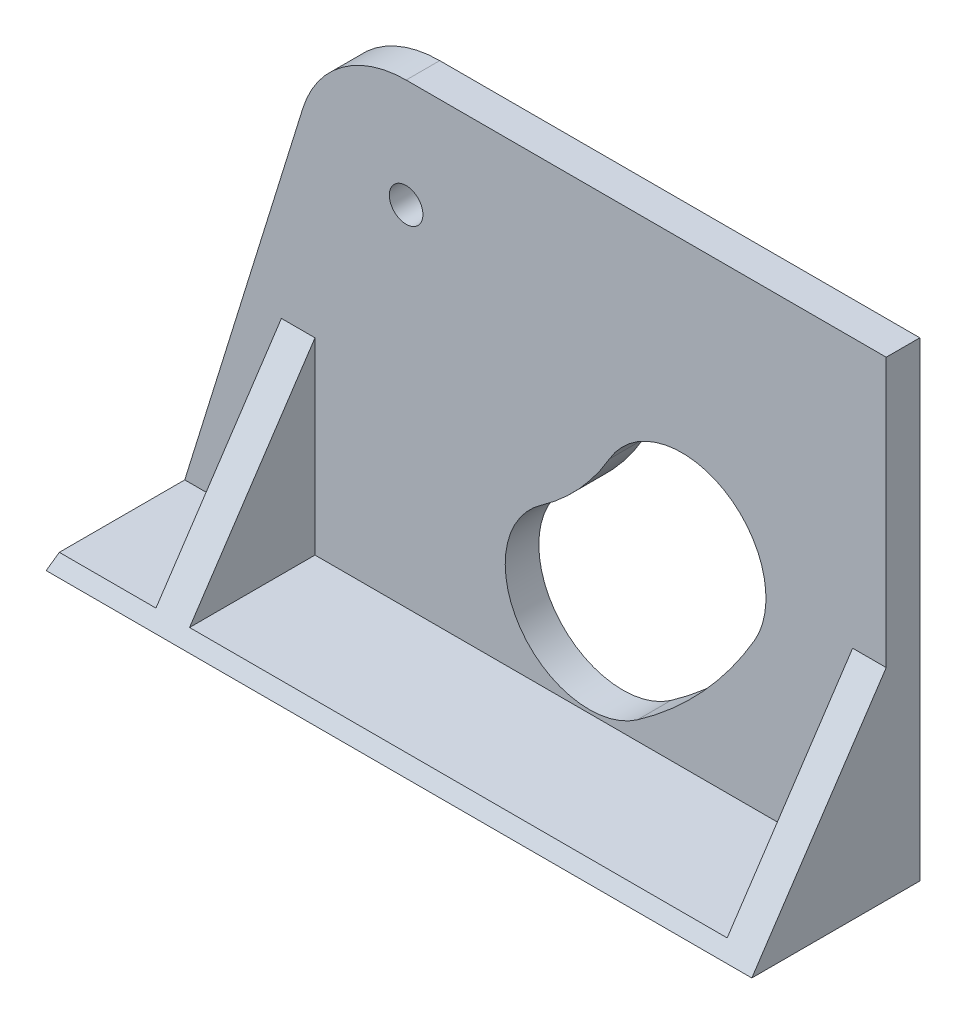
ISO-10303-21;
HEADER;
FILE_DESCRIPTION(('STEP AP214'),'2;1');
FILE_NAME('part.step','',(''),(''),'','','');
FILE_SCHEMA(('AUTOMOTIVE_DESIGN { 1 0 10303 214 1 1 1 1 }'));
ENDSEC;
DATA;
#1=APPLICATION_CONTEXT('core data for automotive mechanical design processes');
#2=APPLICATION_PROTOCOL_DEFINITION('international standard','automotive_design',2000,#1);
#3=PRODUCT_CONTEXT('',#1,'mechanical');
#4=PRODUCT('Part','Part','',(#3));
#5=PRODUCT_RELATED_PRODUCT_CATEGORY('part','',(#4));
#6=PRODUCT_DEFINITION_FORMATION('','',#4);
#7=PRODUCT_DEFINITION_CONTEXT('part definition',#1,'design');
#8=PRODUCT_DEFINITION('design','',#6,#7);
#9=PRODUCT_DEFINITION_SHAPE('','',#8);
#10=(LENGTH_UNIT() NAMED_UNIT(*) SI_UNIT(.MILLI.,.METRE.));
#11=(NAMED_UNIT(*) PLANE_ANGLE_UNIT() SI_UNIT($,.RADIAN.));
#12=(NAMED_UNIT(*) SI_UNIT($,.STERADIAN.) SOLID_ANGLE_UNIT());
#13=UNCERTAINTY_MEASURE_WITH_UNIT(LENGTH_MEASURE(1.E-05),#10,'distance_accuracy_value','');
#14=(GEOMETRIC_REPRESENTATION_CONTEXT(3) GLOBAL_UNCERTAINTY_ASSIGNED_CONTEXT((#13)) GLOBAL_UNIT_ASSIGNED_CONTEXT((#10,
#11,#12)) REPRESENTATION_CONTEXT('',''));
#15=CARTESIAN_POINT('',(0.,0.,0.));
#16=DIRECTION('',(0.,0.,1.));
#17=DIRECTION('',(1.,0.,0.));
#18=AXIS2_PLACEMENT_3D('',#15,#16,#17);
#19=CARTESIAN_POINT('',(120.,2.,30.));
#20=DIRECTION('',(0.,1.,0.));
#21=DIRECTION('',(-1.,0.,0.));
#22=AXIS2_PLACEMENT_3D('',#19,#20,#21);
#23=PLANE('',#22);
#24=DIRECTION('',(0.,0.,-1.));
#25=VECTOR('',#24,1.);
#26=CARTESIAN_POINT('',(35.,2.,30.));
#27=LINE('',#26,#25);
#28=CARTESIAN_POINT('',(35.,2.,28.6666666666667));
#29=VERTEX_POINT('',#28);
#30=CARTESIAN_POINT('',(35.,2.,10.));
#31=VERTEX_POINT('',#30);
#32=EDGE_CURVE('E201',#29,#31,#27,.T.);
#33=ORIENTED_EDGE('',*,*,#32,.F.);
#34=DIRECTION('',(1.,0.,0.));
#35=VECTOR('',#34,1.);
#36=CARTESIAN_POINT('',(120.,2.,28.6666666666667));
#37=LINE('',#36,#35);
#38=CARTESIAN_POINT('',(115.,2.,28.6666666666667));
#39=VERTEX_POINT('',#38);
#40=EDGE_CURVE('E280',#29,#39,#37,.T.);
#41=ORIENTED_EDGE('',*,*,#40,.T.);
#42=DIRECTION('',(0.,0.,1.));
#43=VECTOR('',#42,1.);
#44=CARTESIAN_POINT('',(115.,2.,30.));
#45=LINE('',#44,#43);
#46=CARTESIAN_POINT('',(115.,2.,10.));
#47=VERTEX_POINT('',#46);
#48=EDGE_CURVE('E213',#47,#39,#45,.T.);
#49=ORIENTED_EDGE('',*,*,#48,.F.);
#50=DIRECTION('',(1.,0.,0.));
#51=VECTOR('',#50,1.);
#52=CARTESIAN_POINT('',(120.,2.,10.));
#53=LINE('',#52,#51);
#54=EDGE_CURVE('E227',#31,#47,#53,.T.);
#55=ORIENTED_EDGE('',*,*,#54,.F.);
#56=EDGE_LOOP('',(#33,#41,#49,#55));
#57=FACE_BOUND('',#56,.T.);
#58=ADVANCED_FACE('F33',(#57),#23,.T.);
#59=CARTESIAN_POINT('',(35.,0.,30.));
#60=DIRECTION('',(1.,0.,0.));
#61=DIRECTION('',(0.,0.,-1.));
#62=AXIS2_PLACEMENT_3D('',#59,#60,#61);
#63=PLANE('',#62);
#64=DIRECTION('',(0.,-1.,0.));
#65=VECTOR('',#64,1.);
#66=CARTESIAN_POINT('',(35.,0.,10.));
#67=LINE('',#66,#65);
#68=CARTESIAN_POINT('',(35.,30.,10.));
#69=VERTEX_POINT('',#68);
#70=EDGE_CURVE('E203',#69,#31,#67,.T.);
#71=ORIENTED_EDGE('',*,*,#70,.F.);
#72=DIRECTION('',(0.,-0.832050294337844,0.554700196225229));
#73=VECTOR('',#72,1.);
#74=CARTESIAN_POINT('',(35.,0.,30.));
#75=LINE('',#74,#73);
#76=EDGE_CURVE('E277',#69,#29,#75,.T.);
#77=ORIENTED_EDGE('',*,*,#76,.T.);
#78=ORIENTED_EDGE('',*,*,#32,.T.);
#79=EDGE_LOOP('',(#71,#77,#78));
#80=FACE_BOUND('',#79,.T.);
#81=ADVANCED_FACE('F308',(#80),#63,.T.);
#82=CARTESIAN_POINT('',(30.,0.,30.));
#83=DIRECTION('',(-1.,0.,0.));
#84=DIRECTION('',(0.,0.,1.));
#85=AXIS2_PLACEMENT_3D('',#82,#83,#84);
#86=PLANE('',#85);
#87=DIRECTION('',(0.,0.,1.));
#88=VECTOR('',#87,1.);
#89=CARTESIAN_POINT('',(30.,2.,30.));
#90=LINE('',#89,#88);
#91=CARTESIAN_POINT('',(30.,2.,10.));
#92=VERTEX_POINT('',#91);
#93=CARTESIAN_POINT('',(30.,2.,28.6666666666667));
#94=VERTEX_POINT('',#93);
#95=EDGE_CURVE('E186',#92,#94,#90,.T.);
#96=ORIENTED_EDGE('',*,*,#95,.T.);
#97=DIRECTION('',(0.,0.832050294337844,-0.554700196225229));
#98=VECTOR('',#97,1.);
#99=CARTESIAN_POINT('',(30.,0.,30.));
#100=LINE('',#99,#98);
#101=CARTESIAN_POINT('',(30.,30.,10.));
#102=VERTEX_POINT('',#101);
#103=EDGE_CURVE('E41',#94,#102,#100,.T.);
#104=ORIENTED_EDGE('',*,*,#103,.T.);
#105=DIRECTION('',(0.,1.,0.));
#106=VECTOR('',#105,1.);
#107=CARTESIAN_POINT('',(30.,0.,10.));
#108=LINE('',#107,#106);
#109=EDGE_CURVE('E185',#92,#102,#108,.T.);
#110=ORIENTED_EDGE('',*,*,#109,.F.);
#111=EDGE_LOOP('',(#96,#104,#110));
#112=FACE_BOUND('',#111,.T.);
#113=ADVANCED_FACE('F184',(#112),#86,.T.);
#114=CARTESIAN_POINT('',(115.,30.,30.));
#115=DIRECTION('',(-1.,0.,0.));
#116=DIRECTION('',(0.,0.,1.));
#117=AXIS2_PLACEMENT_3D('',#114,#115,#116);
#118=PLANE('',#117);
#119=ORIENTED_EDGE('',*,*,#48,.T.);
#120=DIRECTION('',(0.,0.832050294337844,-0.554700196225229));
#121=VECTOR('',#120,1.);
#122=CARTESIAN_POINT('',(115.,20.7692307692308,16.1538461538462));
#123=LINE('',#122,#121);
#124=CARTESIAN_POINT('',(115.,30.,10.));
#125=VERTEX_POINT('',#124);
#126=EDGE_CURVE('E283',#39,#125,#123,.T.);
#127=ORIENTED_EDGE('',*,*,#126,.T.);
#128=DIRECTION('',(0.,1.,0.));
#129=VECTOR('',#128,1.);
#130=CARTESIAN_POINT('',(115.,30.,10.));
#131=LINE('',#130,#129);
#132=EDGE_CURVE('E211',#47,#125,#131,.T.);
#133=ORIENTED_EDGE('',*,*,#132,.F.);
#134=EDGE_LOOP('',(#119,#127,#133));
#135=FACE_BOUND('',#134,.T.);
#136=ADVANCED_FACE('F292',(#135),#118,.T.);
#137=DIRECTION('',(0.,0.,1.));
#138=VECTOR('',#137,1.);
#139=CARTESIAN_POINT('',(15.6201258255503,2.,30.));
#140=LINE('',#139,#138);
#141=CARTESIAN_POINT('',(15.6201258255503,2.,10.));
#142=VERTEX_POINT('',#141);
#143=CARTESIAN_POINT('',(15.6201258255503,2.,28.6666666666667));
#144=VERTEX_POINT('',#143);
#145=EDGE_CURVE('E216',#142,#144,#140,.T.);
#146=ORIENTED_EDGE('',*,*,#145,.T.);
#147=DIRECTION('',(1.,0.,0.));
#148=VECTOR('',#147,1.);
#149=CARTESIAN_POINT('',(120.,2.,28.6666666666667));
#150=LINE('',#149,#148);
#151=EDGE_CURVE('E273',#144,#94,#150,.T.);
#152=ORIENTED_EDGE('',*,*,#151,.T.);
#153=ORIENTED_EDGE('',*,*,#95,.F.);
#154=EDGE_CURVE('E199',#142,#92,#53,.T.);
#155=ORIENTED_EDGE('',*,*,#154,.F.);
#156=EDGE_LOOP('',(#146,#152,#153,#155));
#157=FACE_BOUND('',#156,.T.);
#158=ADVANCED_FACE('F296',(#157),#23,.T.);
#159=CARTESIAN_POINT('',(15.,30.,10.));
#160=DIRECTION('',(0.,0.554700196225229,0.832050294337844));
#161=DIRECTION('',(0.,-0.832050294337844,0.554700196225229));
#162=AXIS2_PLACEMENT_3D('',#159,#160,#161);
#163=PLANE('',#162);
#164=ORIENTED_EDGE('',*,*,#40,.F.);
#165=ORIENTED_EDGE('',*,*,#76,.F.);
#166=DIRECTION('',(1.,0.,0.));
#167=VECTOR('',#166,1.);
#168=CARTESIAN_POINT('',(35.,30.,10.));
#169=LINE('',#168,#167);
#170=EDGE_CURVE('E196',#102,#69,#169,.T.);
#171=ORIENTED_EDGE('',*,*,#170,.F.);
#172=ORIENTED_EDGE('',*,*,#103,.F.);
#173=ORIENTED_EDGE('',*,*,#151,.F.);
#174=DIRECTION('',(-0.24980849785958,-0.805670357746806,0.537113571831204));
#175=VECTOR('',#174,1.);
#176=CARTESIAN_POINT('',(34.6531998796651,63.3845554238102,-12.2563702825401));
#177=LINE('',#176,#175);
#178=CARTESIAN_POINT('',(15.,0.,30.));
#179=VERTEX_POINT('',#178);
#180=EDGE_CURVE('E275',#144,#179,#177,.T.);
#181=ORIENTED_EDGE('',*,*,#180,.T.);
#182=DIRECTION('',(-1.,0.,0.));
#183=VECTOR('',#182,1.);
#184=CARTESIAN_POINT('',(120.,0.,30.));
#185=LINE('',#184,#183);
#186=CARTESIAN_POINT('',(120.,0.,30.));
#187=VERTEX_POINT('',#186);
#188=EDGE_CURVE('E159',#187,#179,#185,.T.);
#189=ORIENTED_EDGE('',*,*,#188,.F.);
#190=DIRECTION('',(0.,-0.832050294337844,0.554700196225229));
#191=VECTOR('',#190,1.);
#192=CARTESIAN_POINT('',(120.,30.,10.));
#193=LINE('',#192,#191);
#194=CARTESIAN_POINT('',(120.,30.,10.));
#195=VERTEX_POINT('',#194);
#196=EDGE_CURVE('E257',#195,#187,#193,.T.);
#197=ORIENTED_EDGE('',*,*,#196,.F.);
#198=DIRECTION('',(1.,0.,0.));
#199=VECTOR('',#198,1.);
#200=CARTESIAN_POINT('',(120.,30.,10.));
#201=LINE('',#200,#199);
#202=EDGE_CURVE('E208',#125,#195,#201,.T.);
#203=ORIENTED_EDGE('',*,*,#202,.F.);
#204=ORIENTED_EDGE('',*,*,#126,.F.);
#205=EDGE_LOOP('',(#164,#165,#171,#172,#173,#181,#189,#197,#203,#204));
#206=FACE_BOUND('',#205,.T.);
#207=ADVANCED_FACE('F293',(#206),#163,.T.);
#208=CARTESIAN_POINT('',(48.5613886077065,53.9097221037271,0.));
#209=DIRECTION('',(0.,0.,1.));
#210=DIRECTION('',(1.,0.,0.));
#211=AXIS2_PLACEMENT_3D('',#208,#209,#210);
#212=CYLINDRICAL_SURFACE('',#211,2.5);
#213=CARTESIAN_POINT('',(48.5613886077065,53.9097221037271,5.));
#214=DIRECTION('',(0.,0.,1.));
#215=DIRECTION('',(0.,-1.,0.));
#216=AXIS2_PLACEMENT_3D('',#213,#214,#215);
#217=CIRCLE('',#216,2.5);
#218=CARTESIAN_POINT('',(48.5613886077065,51.4097221037271,5.));
#219=VERTEX_POINT('',#218);
#220=EDGE_CURVE('E269',#219,#219,#217,.F.);
#221=ORIENTED_EDGE('',*,*,#220,.T.);
#222=EDGE_LOOP('',(#221));
#223=FACE_BOUND('',#222,.T.);
#224=CARTESIAN_POINT('',(48.5613886077065,53.9097221037271,10.));
#225=DIRECTION('',(0.,0.,1.));
#226=DIRECTION('',(1.,0.,0.));
#227=AXIS2_PLACEMENT_3D('',#224,#225,#226);
#228=CIRCLE('',#227,2.5);
#229=CARTESIAN_POINT('',(51.0613886077065,53.9097221037271,10.));
#230=VERTEX_POINT('',#229);
#231=EDGE_CURVE('E229',#230,#230,#228,.T.);
#232=ORIENTED_EDGE('',*,*,#231,.T.);
#233=EDGE_LOOP('',(#232));
#234=FACE_BOUND('',#233,.T.);
#235=ADVANCED_FACE('F303',(#223,#234),#212,.F.);
#236=CARTESIAN_POINT('',(48.5613886077065,53.9097221037271,0.));
#237=DIRECTION('',(0.,0.,1.));
#238=DIRECTION('',(1.,0.,0.));
#239=AXIS2_PLACEMENT_3D('',#236,#237,#238);
#240=CYLINDRICAL_SURFACE('',#239,60.);
#241=DIRECTION('',(0.,0.,1.));
#242=VECTOR('',#241,1.);
#243=CARTESIAN_POINT('',(100.405906553685,23.7079678674402,0.));
#244=LINE('',#243,#242);
#245=CARTESIAN_POINT('',(100.405906553685,23.7079678674402,5.));
#246=VERTEX_POINT('',#245);
#247=CARTESIAN_POINT('',(100.405906553685,23.7079678674402,10.));
#248=VERTEX_POINT('',#247);
#249=EDGE_CURVE('E174',#246,#248,#244,.T.);
#250=ORIENTED_EDGE('',*,*,#249,.F.);
#251=CARTESIAN_POINT('',(48.5613886077065,53.9097221037271,5.));
#252=DIRECTION('',(0.,0.,1.));
#253=DIRECTION('',(0.,-1.,0.));
#254=AXIS2_PLACEMENT_3D('',#251,#252,#253);
#255=CIRCLE('',#254,60.);
#256=CARTESIAN_POINT('',(82.9759747887693,4.76059944638758,4.99999999999999));
#257=VERTEX_POINT('',#256);
#258=EDGE_CURVE('E156',#246,#257,#255,.F.);
#259=ORIENTED_EDGE('',*,*,#258,.T.);
#260=DIRECTION('',(0.,0.,1.));
#261=VECTOR('',#260,1.);
#262=CARTESIAN_POINT('',(82.9759747887693,4.76059944638758,0.));
#263=LINE('',#262,#261);
#264=CARTESIAN_POINT('',(82.9759747887693,4.76059944638758,10.));
#265=VERTEX_POINT('',#264);
#266=EDGE_CURVE('E176',#257,#265,#263,.T.);
#267=ORIENTED_EDGE('',*,*,#266,.T.);
#268=CARTESIAN_POINT('',(48.5613886077065,53.9097221037271,10.));
#269=DIRECTION('',(0.,0.,1.));
#270=DIRECTION('',(1.,0.,0.));
#271=AXIS2_PLACEMENT_3D('',#268,#269,#270);
#272=CIRCLE('',#271,60.);
#273=EDGE_CURVE('E165',#265,#248,#272,.T.);
#274=ORIENTED_EDGE('',*,*,#273,.T.);
#275=EDGE_LOOP('',(#250,#259,#267,#274));
#276=FACE_BOUND('',#275,.T.);
#277=ADVANCED_FACE('F408',(#276),#240,.F.);
#278=CARTESIAN_POINT('',(89.6049653149398,30.,0.));
#279=DIRECTION('',(0.,0.,1.));
#280=DIRECTION('',(1.,0.,0.));
#281=AXIS2_PLACEMENT_3D('',#278,#279,#280);
#282=CYLINDRICAL_SURFACE('',#281,12.5);
#283=DIRECTION('',(0.,0.,1.));
#284=VECTOR('',#283,1.);
#285=CARTESIAN_POINT('',(78.8040240761942,36.2920321325597,0.));
#286=LINE('',#285,#284);
#287=CARTESIAN_POINT('',(78.8040240761942,36.2920321325597,5.));
#288=VERTEX_POINT('',#287);
#289=CARTESIAN_POINT('',(78.8040240761942,36.2920321325597,10.));
#290=VERTEX_POINT('',#289);
#291=EDGE_CURVE('E172',#288,#290,#286,.T.);
#292=ORIENTED_EDGE('',*,*,#291,.F.);
#293=CARTESIAN_POINT('',(89.6049653149398,30.,5.));
#294=DIRECTION('',(0.,0.,1.));
#295=DIRECTION('',(0.,-1.,0.));
#296=AXIS2_PLACEMENT_3D('',#293,#294,#295);
#297=CIRCLE('',#296,12.5);
#298=EDGE_CURVE('E262',#288,#246,#297,.F.);
#299=ORIENTED_EDGE('',*,*,#298,.T.);
#300=ORIENTED_EDGE('',*,*,#249,.T.);
#301=CARTESIAN_POINT('',(89.6049653149398,30.,10.));
#302=DIRECTION('',(0.,0.,1.));
#303=DIRECTION('',(1.,0.,0.));
#304=AXIS2_PLACEMENT_3D('',#301,#302,#303);
#305=CIRCLE('',#304,12.5);
#306=EDGE_CURVE('E237',#248,#290,#305,.T.);
#307=ORIENTED_EDGE('',*,*,#306,.T.);
#308=EDGE_LOOP('',(#292,#299,#300,#307));
#309=FACE_BOUND('',#308,.T.);
#310=ADVANCED_FACE('F397',(#309),#282,.F.);
#311=CARTESIAN_POINT('',(48.5613886077065,53.9097221037271,0.));
#312=DIRECTION('',(0.,0.,1.));
#313=DIRECTION('',(1.,0.,0.));
#314=AXIS2_PLACEMENT_3D('',#311,#312,#313);
#315=CYLINDRICAL_SURFACE('',#314,35.);
#316=DIRECTION('',(0.,0.,1.));
#317=VECTOR('',#316,1.);
#318=CARTESIAN_POINT('',(68.6365638799931,25.2394005536123,0.));
#319=LINE('',#318,#317);
#320=CARTESIAN_POINT('',(68.6365638799931,25.2394005536123,5.));
#321=VERTEX_POINT('',#320);
#322=CARTESIAN_POINT('',(68.6365638799931,25.2394005536123,10.));
#323=VERTEX_POINT('',#322);
#324=EDGE_CURVE('E169',#321,#323,#319,.T.);
#325=ORIENTED_EDGE('',*,*,#324,.F.);
#326=CARTESIAN_POINT('',(48.5613886077065,53.9097221037271,5.));
#327=DIRECTION('',(0.,0.,1.));
#328=DIRECTION('',(0.,-1.,0.));
#329=AXIS2_PLACEMENT_3D('',#326,#327,#328);
#330=CIRCLE('',#329,35.);
#331=EDGE_CURVE('E265',#321,#288,#330,.T.);
#332=ORIENTED_EDGE('',*,*,#331,.T.);
#333=ORIENTED_EDGE('',*,*,#291,.T.);
#334=CARTESIAN_POINT('',(48.5613886077065,53.9097221037271,10.));
#335=DIRECTION('',(0.,0.,-1.));
#336=DIRECTION('',(1.,0.,0.));
#337=AXIS2_PLACEMENT_3D('',#334,#335,#336);
#338=CIRCLE('',#337,35.);
#339=EDGE_CURVE('E234',#290,#323,#338,.T.);
#340=ORIENTED_EDGE('',*,*,#339,.T.);
#341=EDGE_LOOP('',(#325,#332,#333,#340));
#342=FACE_BOUND('',#341,.T.);
#343=ADVANCED_FACE('F385',(#342),#315,.T.);
#344=CARTESIAN_POINT('',(75.8062693343812,15.,0.));
#345=DIRECTION('',(0.,0.,1.));
#346=DIRECTION('',(1.,0.,0.));
#347=AXIS2_PLACEMENT_3D('',#344,#345,#346);
#348=CYLINDRICAL_SURFACE('',#347,12.5);
#349=ORIENTED_EDGE('',*,*,#266,.F.);
#350=CARTESIAN_POINT('',(75.8062693343812,15.,5.));
#351=DIRECTION('',(0.,0.,1.));
#352=DIRECTION('',(0.,-1.,0.));
#353=AXIS2_PLACEMENT_3D('',#350,#351,#352);
#354=CIRCLE('',#353,12.5);
#355=EDGE_CURVE('E48',#257,#321,#354,.F.);
#356=ORIENTED_EDGE('',*,*,#355,.T.);
#357=ORIENTED_EDGE('',*,*,#324,.T.);
#358=CARTESIAN_POINT('',(75.8062693343812,15.,10.));
#359=DIRECTION('',(0.,0.,1.));
#360=DIRECTION('',(1.,0.,0.));
#361=AXIS2_PLACEMENT_3D('',#358,#359,#360);
#362=CIRCLE('',#361,12.5);
#363=EDGE_CURVE('E231',#323,#265,#362,.T.);
#364=ORIENTED_EDGE('',*,*,#363,.T.);
#365=EDGE_LOOP('',(#349,#356,#357,#364));
#366=FACE_BOUND('',#365,.T.);
#367=ADVANCED_FACE('F366',(#366),#348,.F.);
#368=CARTESIAN_POINT('',(0.,0.,10.));
#369=DIRECTION('',(0.,0.,1.));
#370=DIRECTION('',(-1.,0.,0.));
#371=AXIS2_PLACEMENT_3D('',#368,#369,#370);
#372=PLANE('',#371);
#373=ORIENTED_EDGE('',*,*,#339,.F.);
#374=ORIENTED_EDGE('',*,*,#306,.F.);
#375=ORIENTED_EDGE('',*,*,#273,.F.);
#376=ORIENTED_EDGE('',*,*,#363,.F.);
#377=EDGE_LOOP('',(#373,#374,#375,#376));
#378=FACE_BOUND('',#377,.T.);
#379=ORIENTED_EDGE('',*,*,#132,.T.);
#380=ORIENTED_EDGE('',*,*,#202,.T.);
#381=DIRECTION('',(0.,1.,0.));
#382=VECTOR('',#381,1.);
#383=CARTESIAN_POINT('',(120.,0.,10.));
#384=LINE('',#383,#382);
#385=CARTESIAN_POINT('',(120.,70.,10.));
#386=VERTEX_POINT('',#385);
#387=EDGE_CURVE('E160',#195,#386,#384,.T.);
#388=ORIENTED_EDGE('',*,*,#387,.T.);
#389=DIRECTION('',(-1.,0.,0.));
#390=VECTOR('',#389,1.);
#391=CARTESIAN_POINT('',(0.,70.,10.));
#392=LINE('',#391,#390);
#393=CARTESIAN_POINT('',(48.5613886077065,70.,10.));
#394=VERTEX_POINT('',#393);
#395=EDGE_CURVE('E221',#386,#394,#392,.T.);
#396=ORIENTED_EDGE('',*,*,#395,.T.);
#397=CARTESIAN_POINT('',(48.5613886077065,53.9097221037271,10.));
#398=DIRECTION('',(0.,0.,1.));
#399=DIRECTION('',(1.,0.,0.));
#400=AXIS2_PLACEMENT_3D('',#397,#398,#399);
#401=CIRCLE('',#400,16.0902778962729);
#402=CARTESIAN_POINT('',(33.1929152722023,58.6749157110409,10.));
#403=VERTEX_POINT('',#402);
#404=EDGE_CURVE('E224',#394,#403,#401,.T.);
#405=ORIENTED_EDGE('',*,*,#404,.T.);
#406=DIRECTION('',(-0.296153592749172,-0.9551403297431,0.));
#407=VECTOR('',#406,1.);
#408=CARTESIAN_POINT('',(13.6843957425264,-4.24302360349572,10.));
#409=LINE('',#408,#407);
#410=EDGE_CURVE('E219',#403,#142,#409,.T.);
#411=ORIENTED_EDGE('',*,*,#410,.T.);
#412=ORIENTED_EDGE('',*,*,#154,.T.);
#413=ORIENTED_EDGE('',*,*,#109,.T.);
#414=ORIENTED_EDGE('',*,*,#170,.T.);
#415=ORIENTED_EDGE('',*,*,#70,.T.);
#416=ORIENTED_EDGE('',*,*,#54,.T.);
#417=EDGE_LOOP('',(#379,#380,#388,#396,#405,#411,#412,#413,#414,#415,#416));
#418=FACE_BOUND('',#417,.T.);
#419=ORIENTED_EDGE('',*,*,#231,.F.);
#420=EDGE_LOOP('',(#419));
#421=FACE_BOUND('',#420,.T.);
#422=ADVANCED_FACE('F193',(#378,#418,#421),#372,.T.);
#423=CARTESIAN_POINT('',(0.,0.,5.));
#424=DIRECTION('',(0.,1.,0.));
#425=DIRECTION('',(0.,0.,1.));
#426=AXIS2_PLACEMENT_3D('',#423,#424,#425);
#427=PLANE('',#426);
#428=DIRECTION('',(0.,0.,1.));
#429=VECTOR('',#428,1.);
#430=CARTESIAN_POINT('',(15.,0.,-20.));
#431=LINE('',#430,#429);
#432=CARTESIAN_POINT('',(15.,0.,5.));
#433=VERTEX_POINT('',#432);
#434=EDGE_CURVE('E152',#433,#179,#431,.T.);
#435=ORIENTED_EDGE('',*,*,#434,.F.);
#436=DIRECTION('',(1.,0.,0.));
#437=VECTOR('',#436,1.);
#438=CARTESIAN_POINT('',(15.,0.,5.));
#439=LINE('',#438,#437);
#440=CARTESIAN_POINT('',(120.,0.,5.));
#441=VERTEX_POINT('',#440);
#442=EDGE_CURVE('E137',#433,#441,#439,.T.);
#443=ORIENTED_EDGE('',*,*,#442,.T.);
#444=DIRECTION('',(0.,0.,-1.));
#445=VECTOR('',#444,1.);
#446=CARTESIAN_POINT('',(120.,0.,5.));
#447=LINE('',#446,#445);
#448=EDGE_CURVE('E171',#187,#441,#447,.T.);
#449=ORIENTED_EDGE('',*,*,#448,.F.);
#450=ORIENTED_EDGE('',*,*,#188,.T.);
#451=EDGE_LOOP('',(#435,#443,#449,#450));
#452=FACE_BOUND('',#451,.T.);
#453=ADVANCED_FACE('F35',(#452),#427,.F.);
#454=CARTESIAN_POINT('',(48.5613886077065,53.9097221037271,-20.));
#455=DIRECTION('',(0.,0.,1.));
#456=DIRECTION('',(1.,0.,0.));
#457=AXIS2_PLACEMENT_3D('',#454,#455,#456);
#458=CYLINDRICAL_SURFACE('',#457,16.0902778962729);
#459=DIRECTION('',(0.,0.,1.));
#460=VECTOR('',#459,1.);
#461=CARTESIAN_POINT('',(48.5613886077065,70.,-20.));
#462=LINE('',#461,#460);
#463=CARTESIAN_POINT('',(48.5613886077065,70.,5.));
#464=VERTEX_POINT('',#463);
#465=EDGE_CURVE('E162',#464,#394,#462,.T.);
#466=ORIENTED_EDGE('',*,*,#465,.F.);
#467=CARTESIAN_POINT('',(48.5613886077065,53.9097221037271,5.));
#468=DIRECTION('',(0.,0.,1.));
#469=DIRECTION('',(0.,-1.,0.));
#470=AXIS2_PLACEMENT_3D('',#467,#468,#469);
#471=CIRCLE('',#470,16.0902778962729);
#472=CARTESIAN_POINT('',(33.1929152722023,58.6749157110409,5.));
#473=VERTEX_POINT('',#472);
#474=EDGE_CURVE('E11',#464,#473,#471,.T.);
#475=ORIENTED_EDGE('',*,*,#474,.T.);
#476=DIRECTION('',(0.,0.,1.));
#477=VECTOR('',#476,1.);
#478=CARTESIAN_POINT('',(33.1929152722023,58.6749157110409,-20.));
#479=LINE('',#478,#477);
#480=EDGE_CURVE('E155',#473,#403,#479,.T.);
#481=ORIENTED_EDGE('',*,*,#480,.T.);
#482=ORIENTED_EDGE('',*,*,#404,.F.);
#483=EDGE_LOOP('',(#466,#475,#481,#482));
#484=FACE_BOUND('',#483,.T.);
#485=ADVANCED_FACE('F252',(#484),#458,.T.);
#486=CARTESIAN_POINT('',(120.,70.,-20.));
#487=DIRECTION('',(0.,-1.,0.));
#488=DIRECTION('',(1.,0.,0.));
#489=AXIS2_PLACEMENT_3D('',#486,#487,#488);
#490=PLANE('',#489);
#491=DIRECTION('',(0.,0.,1.));
#492=VECTOR('',#491,1.);
#493=CARTESIAN_POINT('',(120.,70.,-20.));
#494=LINE('',#493,#492);
#495=CARTESIAN_POINT('',(120.,70.,5.));
#496=VERTEX_POINT('',#495);
#497=EDGE_CURVE('E178',#496,#386,#494,.T.);
#498=ORIENTED_EDGE('',*,*,#497,.F.);
#499=DIRECTION('',(1.,0.,0.));
#500=VECTOR('',#499,1.);
#501=CARTESIAN_POINT('',(15.,70.,5.));
#502=LINE('',#501,#500);
#503=EDGE_CURVE('E146',#464,#496,#502,.T.);
#504=ORIENTED_EDGE('',*,*,#503,.F.);
#505=ORIENTED_EDGE('',*,*,#465,.T.);
#506=ORIENTED_EDGE('',*,*,#395,.F.);
#507=EDGE_LOOP('',(#498,#504,#505,#506));
#508=FACE_BOUND('',#507,.T.);
#509=ADVANCED_FACE('F250',(#508),#490,.F.);
#510=CARTESIAN_POINT('',(33.1929152722023,58.6749157110409,-20.));
#511=DIRECTION('',(0.9551403297431,-0.296153592749172,0.));
#512=DIRECTION('',(0.296153592749172,0.9551403297431,0.));
#513=AXIS2_PLACEMENT_3D('',#510,#511,#512);
#514=PLANE('',#513);
#515=ORIENTED_EDGE('',*,*,#480,.F.);
#516=DIRECTION('',(-0.296153592749172,-0.9551403297431,0.));
#517=VECTOR('',#516,1.);
#518=CARTESIAN_POINT('',(33.1929152722023,58.6749157110409,5.));
#519=LINE('',#518,#517);
#520=EDGE_CURVE('E56',#473,#433,#519,.T.);
#521=ORIENTED_EDGE('',*,*,#520,.T.);
#522=ORIENTED_EDGE('',*,*,#434,.T.);
#523=ORIENTED_EDGE('',*,*,#180,.F.);
#524=ORIENTED_EDGE('',*,*,#145,.F.);
#525=ORIENTED_EDGE('',*,*,#410,.F.);
#526=EDGE_LOOP('',(#515,#521,#522,#523,#524,#525));
#527=FACE_BOUND('',#526,.T.);
#528=ADVANCED_FACE('F150',(#527),#514,.F.);
#529=CARTESIAN_POINT('',(120.,0.,5.));
#530=DIRECTION('',(-1.,0.,0.));
#531=DIRECTION('',(0.,-1.,0.));
#532=AXIS2_PLACEMENT_3D('',#529,#530,#531);
#533=PLANE('',#532);
#534=ORIENTED_EDGE('',*,*,#448,.T.);
#535=DIRECTION('',(0.,-1.,0.));
#536=VECTOR('',#535,1.);
#537=CARTESIAN_POINT('',(120.,70.,5.));
#538=LINE('',#537,#536);
#539=EDGE_CURVE('E141',#496,#441,#538,.T.);
#540=ORIENTED_EDGE('',*,*,#539,.F.);
#541=ORIENTED_EDGE('',*,*,#497,.T.);
#542=ORIENTED_EDGE('',*,*,#387,.F.);
#543=ORIENTED_EDGE('',*,*,#196,.T.);
#544=EDGE_LOOP('',(#534,#540,#541,#542,#543));
#545=FACE_BOUND('',#544,.T.);
#546=ADVANCED_FACE('F256',(#545),#533,.F.);
#547=CARTESIAN_POINT('',(0.,0.,5.));
#548=DIRECTION('',(0.,0.,1.));
#549=DIRECTION('',(-1.,0.,0.));
#550=AXIS2_PLACEMENT_3D('',#547,#548,#549);
#551=PLANE('',#550);
#552=ORIENTED_EDGE('',*,*,#258,.F.);
#553=ORIENTED_EDGE('',*,*,#298,.F.);
#554=ORIENTED_EDGE('',*,*,#331,.F.);
#555=ORIENTED_EDGE('',*,*,#355,.F.);
#556=EDGE_LOOP('',(#552,#553,#554,#555));
#557=FACE_BOUND('',#556,.T.);
#558=ORIENTED_EDGE('',*,*,#474,.F.);
#559=ORIENTED_EDGE('',*,*,#503,.T.);
#560=ORIENTED_EDGE('',*,*,#539,.T.);
#561=ORIENTED_EDGE('',*,*,#442,.F.);
#562=ORIENTED_EDGE('',*,*,#520,.F.);
#563=EDGE_LOOP('',(#558,#559,#560,#561,#562));
#564=FACE_BOUND('',#563,.T.);
#565=ORIENTED_EDGE('',*,*,#220,.F.);
#566=EDGE_LOOP('',(#565));
#567=FACE_BOUND('',#566,.T.);
#568=ADVANCED_FACE('F138',(#557,#564,#567),#551,.F.);
#569=CLOSED_SHELL('',(#58,#81,#113,#136,#158,#207,#235,#277,#310,#343,#367,#422,#453,#485,#509,
#528,#546,#568));
#570=MANIFOLD_SOLID_BREP('B2',#569);
#571=ADVANCED_BREP_SHAPE_REPRESENTATION('',(#18,#570),#14);
#572=SHAPE_DEFINITION_REPRESENTATION(#9,#571);
ENDSEC;
END-ISO-10303-21;
